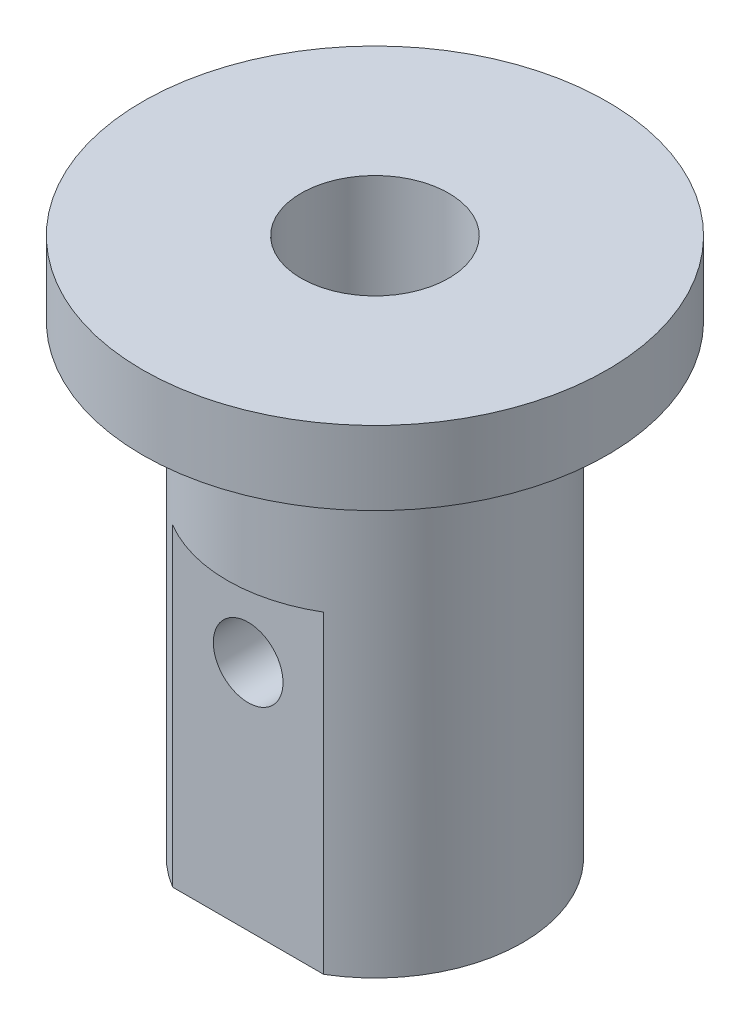
ISO-10303-21;
HEADER;
FILE_DESCRIPTION(('STEP AP214'),'2;1');
FILE_NAME('part.step','',(''),(''),'','','');
FILE_SCHEMA(('AUTOMOTIVE_DESIGN { 1 0 10303 214 1 1 1 1 }'));
ENDSEC;
DATA;
#1=APPLICATION_CONTEXT('core data for automotive mechanical design processes');
#2=APPLICATION_PROTOCOL_DEFINITION('international standard','automotive_design',2000,#1);
#3=PRODUCT_CONTEXT('',#1,'mechanical');
#4=PRODUCT('Part','Part','',(#3));
#5=PRODUCT_RELATED_PRODUCT_CATEGORY('part','',(#4));
#6=PRODUCT_DEFINITION_FORMATION('','',#4);
#7=PRODUCT_DEFINITION_CONTEXT('part definition',#1,'design');
#8=PRODUCT_DEFINITION('design','',#6,#7);
#9=PRODUCT_DEFINITION_SHAPE('','',#8);
#10=(LENGTH_UNIT() NAMED_UNIT(*) SI_UNIT(.MILLI.,.METRE.));
#11=(NAMED_UNIT(*) PLANE_ANGLE_UNIT() SI_UNIT($,.RADIAN.));
#12=(NAMED_UNIT(*) SI_UNIT($,.STERADIAN.) SOLID_ANGLE_UNIT());
#13=UNCERTAINTY_MEASURE_WITH_UNIT(LENGTH_MEASURE(1.E-05),#10,'distance_accuracy_value','');
#14=(GEOMETRIC_REPRESENTATION_CONTEXT(3) GLOBAL_UNCERTAINTY_ASSIGNED_CONTEXT((#13)) GLOBAL_UNIT_ASSIGNED_CONTEXT((#10,
#11,#12)) REPRESENTATION_CONTEXT('',''));
#15=CARTESIAN_POINT('',(0.,0.,0.));
#16=DIRECTION('',(0.,0.,1.));
#17=DIRECTION('',(1.,0.,0.));
#18=AXIS2_PLACEMENT_3D('',#15,#16,#17);
#19=CARTESIAN_POINT('',(0.,20.,0.));
#20=DIRECTION('',(0.,-1.,0.));
#21=DIRECTION('',(0.,0.,-1.));
#22=AXIS2_PLACEMENT_3D('',#19,#20,#21);
#23=CYLINDRICAL_SURFACE('',#22,6.35);
#24=CARTESIAN_POINT('',(0.,20.,0.));
#25=DIRECTION('',(0.,1.,0.));
#26=DIRECTION('',(0.,0.,1.));
#27=AXIS2_PLACEMENT_3D('',#24,#25,#26);
#28=CIRCLE('',#27,6.35);
#29=CARTESIAN_POINT('',(0.,20.,6.35));
#30=VERTEX_POINT('',#29);
#31=EDGE_CURVE('E124',#30,#30,#28,.T.);
#32=ORIENTED_EDGE('',*,*,#31,.F.);
#33=EDGE_LOOP('',(#32));
#34=FACE_BOUND('',#33,.T.);
#35=CARTESIAN_POINT('',(0.,13.5,0.));
#36=DIRECTION('',(0.,1.,0.));
#37=DIRECTION('',(0.,0.,1.));
#38=AXIS2_PLACEMENT_3D('',#35,#36,#37);
#39=CIRCLE('',#38,6.35);
#40=CARTESIAN_POINT('',(3.25,13.5,-5.45527267879434));
#41=VERTEX_POINT('',#40);
#42=CARTESIAN_POINT('',(-3.25,13.5,-5.45527267879434));
#43=VERTEX_POINT('',#42);
#44=EDGE_CURVE('E12',#41,#43,#39,.T.);
#45=ORIENTED_EDGE('',*,*,#44,.T.);
#46=DIRECTION('',(0.,-1.,0.));
#47=VECTOR('',#46,1.);
#48=CARTESIAN_POINT('',(-3.25,13.5,-5.45527267879434));
#49=LINE('',#48,#47);
#50=CARTESIAN_POINT('',(-3.25,0.,-5.45527267879434));
#51=VERTEX_POINT('',#50);
#52=EDGE_CURVE('E90',#43,#51,#49,.T.);
#53=ORIENTED_EDGE('',*,*,#52,.T.);
#54=CARTESIAN_POINT('',(0.,0.,0.));
#55=DIRECTION('',(0.,1.,0.));
#56=DIRECTION('',(0.,0.,1.));
#57=AXIS2_PLACEMENT_3D('',#54,#55,#56);
#58=CIRCLE('',#57,6.35);
#59=CARTESIAN_POINT('',(-3.25,0.,5.45527267879434));
#60=VERTEX_POINT('',#59);
#61=EDGE_CURVE('E123',#51,#60,#58,.T.);
#62=ORIENTED_EDGE('',*,*,#61,.T.);
#63=DIRECTION('',(0.,-1.,0.));
#64=VECTOR('',#63,1.);
#65=CARTESIAN_POINT('',(-3.25,13.5,5.45527267879434));
#66=LINE('',#65,#64);
#67=CARTESIAN_POINT('',(-3.25,13.5,5.45527267879434));
#68=VERTEX_POINT('',#67);
#69=EDGE_CURVE('E58',#68,#60,#66,.T.);
#70=ORIENTED_EDGE('',*,*,#69,.F.);
#71=CARTESIAN_POINT('',(0.,13.5,0.));
#72=DIRECTION('',(0.,-1.,0.));
#73=DIRECTION('',(0.,0.,-1.));
#74=AXIS2_PLACEMENT_3D('',#71,#72,#73);
#75=CIRCLE('',#74,6.35);
#76=CARTESIAN_POINT('',(3.25,13.5,5.45527267879434));
#77=VERTEX_POINT('',#76);
#78=EDGE_CURVE('E51',#77,#68,#75,.T.);
#79=ORIENTED_EDGE('',*,*,#78,.F.);
#80=DIRECTION('',(0.,-1.,0.));
#81=VECTOR('',#80,1.);
#82=CARTESIAN_POINT('',(3.25,13.5,5.45527267879434));
#83=LINE('',#82,#81);
#84=CARTESIAN_POINT('',(3.25,0.,5.45527267879434));
#85=VERTEX_POINT('',#84);
#86=EDGE_CURVE('E104',#77,#85,#83,.T.);
#87=ORIENTED_EDGE('',*,*,#86,.T.);
#88=CARTESIAN_POINT('',(3.25,0.,-5.45527267879434));
#89=VERTEX_POINT('',#88);
#90=EDGE_CURVE('E96',#85,#89,#58,.T.);
#91=ORIENTED_EDGE('',*,*,#90,.T.);
#92=DIRECTION('',(0.,-1.,0.));
#93=VECTOR('',#92,1.);
#94=CARTESIAN_POINT('',(3.25,13.5,-5.45527267879434));
#95=LINE('',#94,#93);
#96=EDGE_CURVE('E66',#41,#89,#95,.T.);
#97=ORIENTED_EDGE('',*,*,#96,.F.);
#98=EDGE_LOOP('',(#45,#53,#62,#70,#79,#87,#91,#97));
#99=FACE_BOUND('',#98,.T.);
#100=ADVANCED_FACE('F44',(#34,#99),#23,.T.);
#101=CARTESIAN_POINT('',(0.,20.,0.));
#102=DIRECTION('',(0.,-1.,0.));
#103=DIRECTION('',(0.,0.,-1.));
#104=AXIS2_PLACEMENT_3D('',#101,#102,#103);
#105=CYLINDRICAL_SURFACE('',#104,3.175);
#106=CARTESIAN_POINT('',(-1.5,10.,2.7983253920872));
#107=CARTESIAN_POINT('',(-1.49999523547047,9.92118925239897,2.79833097649977));
#108=CARTESIAN_POINT('',(-1.49374832449328,9.84226438779427,2.80170427159323));
#109=CARTESIAN_POINT('',(-1.4690554061353,9.68678533248531,2.81472644561665));
#110=CARTESIAN_POINT('',(-1.45058101361493,9.61023709283711,2.82438992585351));
#111=CARTESIAN_POINT('',(-1.40237253355636,9.46204732624327,2.84863009396432));
#112=CARTESIAN_POINT('',(-1.37269332197988,9.39038386356818,2.86318279906116));
#113=CARTESIAN_POINT('',(-1.30308399064543,9.25307060715241,2.89552502377023));
#114=CARTESIAN_POINT('',(-1.26315430701281,9.1874205577211,2.91331440566267));
#115=CARTESIAN_POINT('',(-1.1707430871524,9.0586767547416,2.95172227722859));
#116=CARTESIAN_POINT('',(-1.11755658650795,8.99612211150932,2.97245254188493));
#117=CARTESIAN_POINT('',(-1.00161259672222,8.88040856315064,3.01349951044786));
#118=CARTESIAN_POINT('',(-0.938850772491946,8.82725393739959,3.03381602228766));
#119=CARTESIAN_POINT('',(-0.801034900704516,8.72881062045223,3.07317288716969));
#120=CARTESIAN_POINT('',(-0.725476017233365,8.68416549874825,3.09206866660246));
#121=CARTESIAN_POINT('',(-0.566861686619155,8.60846247793824,3.12503381595021));
#122=CARTESIAN_POINT('',(-0.48381050702355,8.57739690225473,3.13910591174128));
#123=CARTESIAN_POINT('',(-0.318263833167133,8.53180568014383,3.16003750546179));
#124=CARTESIAN_POINT('',(-0.23607983759682,8.5163401993996,3.16730464125021));
#125=CARTESIAN_POINT('',(-0.0699854874354077,8.49931330153705,3.17531500926786));
#126=CARTESIAN_POINT('',(0.0139239243031285,8.49774448287966,3.17606171435844));
#127=CARTESIAN_POINT('',(0.17410404695592,8.50814689261954,3.1711569999128));
#128=CARTESIAN_POINT('',(0.250460926307548,8.5190736315719,3.16599910390162));
#129=CARTESIAN_POINT('',(0.400106757592312,8.55231548800514,3.15058713309443));
#130=CARTESIAN_POINT('',(0.473395481043943,8.57463145199998,3.14033267949386));
#131=CARTESIAN_POINT('',(0.616162159992469,8.63021819188029,3.11549383971164));
#132=CARTESIAN_POINT('',(0.685567785451935,8.66364599997404,3.10084769916082));
#133=CARTESIAN_POINT('',(0.817962218284117,8.74031903647797,3.06858481389696));
#134=CARTESIAN_POINT('',(0.880948663490015,8.78356786011826,3.05096698193041));
#135=CARTESIAN_POINT('',(1.00453666893054,8.88298223432991,3.01265189942243));
#136=CARTESIAN_POINT('',(1.0644578414785,8.93994263196852,2.9918200943109));
#137=CARTESIAN_POINT('',(1.17424124933889,9.06300294035556,2.95046283361779));
#138=CARTESIAN_POINT('',(1.2240971710571,9.12910854404884,2.92993757775203));
#139=CARTESIAN_POINT('',(1.31484174230845,9.27282786184892,2.89039711066438));
#140=CARTESIAN_POINT('',(1.35512986365461,9.35086105800371,2.87151577260243));
#141=CARTESIAN_POINT('',(1.42170562946273,9.51371625646897,2.83914834140001));
#142=CARTESIAN_POINT('',(1.44800645544408,9.59853178012437,2.82565717160027));
#143=CARTESIAN_POINT('',(1.48387059914899,9.7657462952624,2.80697974613979));
#144=CARTESIAN_POINT('',(1.4945499135996,9.84784244193015,2.80124227464673));
#145=CARTESIAN_POINT('',(1.50221328025957,10.0128364544629,2.79714234532468));
#146=CARTESIAN_POINT('',(1.49920488189903,10.0957338532269,2.79877582206013));
#147=CARTESIAN_POINT('',(1.4806017347564,10.2518411011807,2.80865284380239));
#148=CARTESIAN_POINT('',(1.46619608896935,10.3252381335397,2.81627144126264));
#149=CARTESIAN_POINT('',(1.42690562153975,10.4684636330514,2.83637948512089));
#150=CARTESIAN_POINT('',(1.40201781025962,10.5382910757385,2.8488703210638));
#151=CARTESIAN_POINT('',(1.3412324594274,10.676035807525,2.87800314814948));
#152=CARTESIAN_POINT('',(1.30487958898417,10.7437159941401,2.89481019393091));
#153=CARTESIAN_POINT('',(1.22260967416881,10.8723898286007,2.93050507850425));
#154=CARTESIAN_POINT('',(1.17668785898318,10.933380117806,2.94939395301752));
#155=CARTESIAN_POINT('',(1.07066250220429,11.0539512242928,2.98962533435876));
#156=CARTESIAN_POINT('',(1.00955462247668,11.1126390091907,3.0110091844446));
#157=CARTESIAN_POINT('',(0.877952835832726,11.2191662131219,3.05197816465585));
#158=CARTESIAN_POINT('',(0.807456777596014,11.2670031388463,3.07156288076261));
#159=CARTESIAN_POINT('',(0.657374049291597,11.351063404327,3.10717258491727));
#160=CARTESIAN_POINT('',(0.577656753882327,11.3870824417787,3.12313361565429));
#161=CARTESIAN_POINT('',(0.412327293299584,11.4448659350236,3.14922093597641));
#162=CARTESIAN_POINT('',(0.326719797872879,11.4666415423121,3.15935178938716));
#163=CARTESIAN_POINT('',(0.159896332874224,11.4936388943546,3.17197971044583));
#164=CARTESIAN_POINT('',(0.0789253982840799,11.5001101363264,3.17505233840112));
#165=CARTESIAN_POINT('',(-0.0829833461657156,11.4998871196568,3.17494636529876));
#166=CARTESIAN_POINT('',(-0.163921158963002,11.4931965351109,3.17176950877122));
#167=CARTESIAN_POINT('',(-0.318841842835546,11.4677084802309,3.15985410378094));
#168=CARTESIAN_POINT('',(-0.392963167600613,11.4495919749199,3.15142868675494));
#169=CARTESIAN_POINT('',(-0.53702643402249,11.4026210854748,3.13010132928976));
#170=CARTESIAN_POINT('',(-0.606967708474028,11.3737649924088,3.1171986764347));
#171=CARTESIAN_POINT('',(-0.744198443618437,11.3047349018929,3.08738510301285));
#172=CARTESIAN_POINT('',(-0.811226286131092,11.2641093939082,3.0703197298679));
#173=CARTESIAN_POINT('',(-0.937805412907552,11.1732843209197,3.03405477724481));
#174=CARTESIAN_POINT('',(-0.997353281796322,11.1230804085548,3.01485423033003));
#175=CARTESIAN_POINT('',(-1.11287613406119,11.0092844677808,2.97425749382228));
#176=CARTESIAN_POINT('',(-1.16805442942683,10.9448963731736,2.9528185885393));
#177=CARTESIAN_POINT('',(-1.26705651381277,10.8073121457485,2.91171333700677));
#178=CARTESIAN_POINT('',(-1.31087196019012,10.7341095987445,2.89204830000693));
#179=CARTESIAN_POINT('',(-1.3863737982034,10.5792324222108,2.85663554941127));
#180=CARTESIAN_POINT('',(-1.41785130272302,10.4974393525252,2.84095675906997));
#181=CARTESIAN_POINT('',(-1.4661232120466,10.3288119983292,2.81635628214136));
#182=CARTESIAN_POINT('',(-1.48296690968124,10.2419956966721,2.80741192483264));
#183=CARTESIAN_POINT('',(-1.49469268672873,10.128694633248,2.80116429672363));
#184=CARTESIAN_POINT('',(-1.49668048940514,10.1030118077476,2.80010260103933));
#185=CARTESIAN_POINT('',(-1.49933495903092,10.0515567295082,2.79868221732461));
#186=CARTESIAN_POINT('',(-1.50000155880871,10.0257844722891,2.79832356503778));
#187=CARTESIAN_POINT('',(-1.5,10.,2.7983253920872));
#188=B_SPLINE_CURVE_WITH_KNOTS('',3,(#106,#107,#108,#109,#110,#111,#112,#113,#114,#115,#116,
#117,#118,#119,#120,#121,#122,#123,#124,#125,#126,#127,#128,#129,#130,#131,#132,#133,#134,#135,
#136,#137,#138,#139,#140,#141,#142,#143,#144,#145,#146,#147,#148,#149,#150,#151,#152,#153,#154,
#155,#156,#157,#158,#159,#160,#161,#162,#163,#164,#165,#166,#167,#168,#169,#170,#171,#172,#173,
#174,#175,#176,#177,#178,#179,#180,#181,#182,#183,#184,#185,#186,#187),.UNSPECIFIED.,.T.,.F.,(4,
2,2,2,2,2,2,2,2,2,2,2,2,2,2,2,2,2,2,2,2,2,2,2,2,2,2,2,2,2,2,2,2,2,2,2,2,2,2,2,4),(0.,
0.236323871838545,0.473198284289301,0.708927337380701,0.944646362603914,1.19762429635865,
1.45071710395354,1.71864285343498,1.98641694681215,2.23687152724756,2.48719270436037,
2.71802817018661,2.94888079555674,3.1831453100556,3.41749572162706,3.67216706074964,
3.92699765369087,4.19506898546716,4.46288723920479,4.71043828617547,4.95785281342715,
5.18239796950746,5.40700721193729,5.64198832122138,5.87708686716682,6.13804637958084,
6.39906579463174,6.66438519401193,6.92949661955738,7.17207877892644,7.41459323161728,
7.64386670961211,7.87317668624822,8.11282240294707,8.35257714778319,8.61378861881715,
8.87519133270404,9.14084608292566,9.40560248746477,9.48291651801969,9.56023447921351),.UNSPECIFIED.);
#189=CARTESIAN_POINT('',(-1.5,10.,2.7983253920872));
#190=VERTEX_POINT('',#189);
#191=EDGE_CURVE('E129',#190,#190,#188,.T.);
#192=ORIENTED_EDGE('',*,*,#191,.T.);
#193=EDGE_LOOP('',(#192));
#194=FACE_BOUND('',#193,.T.);
#195=CARTESIAN_POINT('',(0.,0.,0.));
#196=DIRECTION('',(0.,1.,0.));
#197=DIRECTION('',(0.,0.,1.));
#198=AXIS2_PLACEMENT_3D('',#195,#196,#197);
#199=CIRCLE('',#198,3.175);
#200=CARTESIAN_POINT('',(0.,0.,3.175));
#201=VERTEX_POINT('',#200);
#202=EDGE_CURVE('E118',#201,#201,#199,.T.);
#203=ORIENTED_EDGE('',*,*,#202,.F.);
#204=EDGE_LOOP('',(#203));
#205=FACE_BOUND('',#204,.T.);
#206=CARTESIAN_POINT('',(0.,23.175,0.));
#207=DIRECTION('',(0.,1.,0.));
#208=DIRECTION('',(0.,0.,1.));
#209=AXIS2_PLACEMENT_3D('',#206,#207,#208);
#210=CIRCLE('',#209,3.175);
#211=CARTESIAN_POINT('',(0.,23.175,3.175));
#212=VERTEX_POINT('',#211);
#213=EDGE_CURVE('E110',#212,#212,#210,.T.);
#214=ORIENTED_EDGE('',*,*,#213,.T.);
#215=EDGE_LOOP('',(#214));
#216=FACE_BOUND('',#215,.T.);
#217=CARTESIAN_POINT('',(0.,11.5,-3.175));
#218=CARTESIAN_POINT('',(0.0793696056331878,11.4999955261035,-3.17499621985294));
#219=CARTESIAN_POINT('',(0.158848966213319,11.4936633534842,-3.17199120370814));
#220=CARTESIAN_POINT('',(0.3154907966577,11.4685996128575,-3.16026762742416));
#221=CARTESIAN_POINT('',(0.392647876041672,11.4498412211258,-3.15153670753249));
#222=CARTESIAN_POINT('',(0.54213461401645,11.4008046338603,-3.1292818514019));
#223=CARTESIAN_POINT('',(0.614481134826974,11.370569474688,-3.11577583396693));
#224=CARTESIAN_POINT('',(0.752982757479881,11.2996444683175,-3.08523557557938));
#225=CARTESIAN_POINT('',(0.819138798737005,11.2589562109142,-3.06820187122341));
#226=CARTESIAN_POINT('',(0.947531977551392,11.1656866275469,-3.03109215002452));
#227=CARTESIAN_POINT('',(1.00934531536298,11.1125689176526,-3.01089949607389));
#228=CARTESIAN_POINT('',(1.12356872804671,10.9970940154181,-2.97016877751052));
#229=CARTESIAN_POINT('',(1.17597245123061,10.9347306335115,-2.94963048974006));
#230=CARTESIAN_POINT('',(1.27340721108708,10.7974843645497,-2.90895734211161));
#231=CARTESIAN_POINT('',(1.31770529611402,10.7220415431448,-2.88894252906622));
#232=CARTESIAN_POINT('',(1.39279860497067,10.5637145060508,-2.85350194913633));
#233=CARTESIAN_POINT('',(1.4236026358555,10.4808351865709,-2.83807319122874));
#234=CARTESIAN_POINT('',(1.46896762087975,10.3148173299765,-2.81484981523147));
#235=CARTESIAN_POINT('',(1.48434942407678,10.2319591045865,-2.80667245171199));
#236=CARTESIAN_POINT('',(1.50096994970779,10.0644666996695,-2.79782290647243));
#237=CARTESIAN_POINT('',(1.5022201551264,9.97983401805994,-2.79714463118969));
#238=CARTESIAN_POINT('',(1.49114871052963,9.82062469140227,-2.80305593263808));
#239=CARTESIAN_POINT('',(1.48022366031689,9.74591684055565,-2.80889771224103));
#240=CARTESIAN_POINT('',(1.44750469243097,9.59955531913525,-2.82589657910714));
#241=CARTESIAN_POINT('',(1.42570787921159,9.52790246774061,-2.83705508237193));
#242=CARTESIAN_POINT('',(1.37144042107045,9.38767854274785,-2.86368711079333));
#243=CARTESIAN_POINT('',(1.33873421633754,9.3192173067294,-2.87925460442575));
#244=CARTESIAN_POINT('',(1.26375034917989,9.18844422930819,-2.91294481240157));
#245=CARTESIAN_POINT('',(1.22146847336964,9.12613511227864,-2.93106865023239));
#246=CARTESIAN_POINT('',(1.12301829304094,9.00211398210142,-2.97027967308475));
#247=CARTESIAN_POINT('',(1.06582685913966,8.94124465826451,-2.99147184174414));
#248=CARTESIAN_POINT('',(0.941911654521739,8.82963307898786,-3.03276969244737));
#249=CARTESIAN_POINT('',(0.875184240523149,8.77889471198725,-3.05287495516681));
#250=CARTESIAN_POINT('',(0.730900451942526,8.68723446950541,-3.09065813188422));
#251=CARTESIAN_POINT('',(0.65303276474939,8.6467498749094,-3.10821737934191));
#252=CARTESIAN_POINT('',(0.490549806409964,8.57976514725872,-3.13795896561378));
#253=CARTESIAN_POINT('',(0.405939389394616,8.55325505672055,-3.15014513198241));
#254=CARTESIAN_POINT('',(0.239325331183663,8.51695327830054,-3.16698849385516));
#255=CARTESIAN_POINT('',(0.157618085372369,8.50603697774867,-3.17215069636453));
#256=CARTESIAN_POINT('',(-0.00662006237334089,8.49776549827472,-3.17605374308904));
#257=CARTESIAN_POINT('',(-0.0891506200914322,8.50040487103399,-3.17479716715133));
#258=CARTESIAN_POINT('',(-0.246790904756254,8.51845895022593,-3.16631250425399));
#259=CARTESIAN_POINT('',(-0.322025617263288,8.53299968212115,-3.15949303898597));
#260=CARTESIAN_POINT('',(-0.468859911387632,8.57312746629385,-3.14106249856194));
#261=CARTESIAN_POINT('',(-0.540459070755478,8.59871579842438,-3.12945086824544));
#262=CARTESIAN_POINT('',(-0.680482664613305,8.66097277598054,-3.10206629000487));
#263=CARTESIAN_POINT('',(-0.748744433690325,8.69795459585581,-3.0861775760538));
#264=CARTESIAN_POINT('',(-0.878333413113474,8.78160542554883,-3.05182842645659));
#265=CARTESIAN_POINT('',(-0.939657562453442,8.82827868585652,-3.0333668635778));
#266=CARTESIAN_POINT('',(-1.05944471500475,8.93484016430619,-2.99374847615918));
#267=CARTESIAN_POINT('',(-1.11715821701519,8.99553803008255,-2.97249840501299));
#268=CARTESIAN_POINT('',(-1.22187582163969,9.12592004337329,-2.9310107026401));
#269=CARTESIAN_POINT('',(-1.26887443843489,9.19560876557417,-2.91077359415055));
#270=CARTESIAN_POINT('',(-1.3523177360002,9.34515860569975,-2.8729842223829));
#271=CARTESIAN_POINT('',(-1.3883357483136,9.42529027685059,-2.85555063245793));
#272=CARTESIAN_POINT('',(-1.44599796651068,9.59157573608092,-2.82679504093384));
#273=CARTESIAN_POINT('',(-1.46765854978947,9.67772253828127,-2.81546607860886));
#274=CARTESIAN_POINT('',(-1.49416555358527,9.84513659709301,-2.80148148307169));
#275=CARTESIAN_POINT('',(-1.50036748851185,9.92613047173134,-2.79812792823293));
#276=CARTESIAN_POINT('',(-1.4995991124721,10.0880256718279,-2.79854075870541));
#277=CARTESIAN_POINT('',(-1.4926327833113,10.1689270178634,-2.80230499174775));
#278=CARTESIAN_POINT('',(-1.46695547456854,10.3218618581667,-2.81582109373829));
#279=CARTESIAN_POINT('',(-1.44918362899975,10.394100315709,-2.82509293077013));
#280=CARTESIAN_POINT('',(-1.40347262111118,10.5345289541074,-2.84807658169596));
#281=CARTESIAN_POINT('',(-1.37553039996267,10.6027179098565,-2.86178973121637));
#282=CARTESIAN_POINT('',(-1.30816165903836,10.7381105518292,-2.89323433363553));
#283=CARTESIAN_POINT('',(-1.26809407534009,10.8049459695603,-2.9111726221189));
#284=CARTESIAN_POINT('',(-1.17838069734069,10.9313607981843,-2.94862781691945));
#285=CARTESIAN_POINT('',(-1.12873032344155,10.9909367174796,-2.96814547541437));
#286=CARTESIAN_POINT('',(-1.01518945377103,11.1075560784686,-3.00898948839188));
#287=CARTESIAN_POINT('',(-0.950355540908532,11.1636938134171,-3.03029315236505));
#288=CARTESIAN_POINT('',(-0.811506446201232,11.2644417542749,-3.07039060771353));
#289=CARTESIAN_POINT('',(-0.737486850130156,11.3090463858981,-3.08918318329392));
#290=CARTESIAN_POINT('',(-0.582310323359668,11.3850463197749,-3.12214803509559));
#291=CARTESIAN_POINT('',(-0.501179295246574,11.4164873338392,-3.13633626105316));
#292=CARTESIAN_POINT('',(-0.334041202489532,11.4649024240255,-3.15849550789229));
#293=CARTESIAN_POINT('',(-0.248049357078899,11.4819192475962,-3.16648489362115));
#294=CARTESIAN_POINT('',(-0.134449327489636,11.4942064333984,-3.17226666174443));
#295=CARTESIAN_POINT('',(-0.10761975081623,11.4963765519968,-3.17328951708221));
#296=CARTESIAN_POINT('',(-0.0538643319459684,11.4992741103809,-3.17465683516496));
#297=CARTESIAN_POINT('',(-0.026938487646813,11.5000015184655,-3.17500128300303));
#298=CARTESIAN_POINT('',(0.,11.5,-3.175));
#299=B_SPLINE_CURVE_WITH_KNOTS('',3,(#217,#218,#219,#220,#221,#222,#223,#224,#225,#226,#227,
#228,#229,#230,#231,#232,#233,#234,#235,#236,#237,#238,#239,#240,#241,#242,#243,#244,#245,#246,
#247,#248,#249,#250,#251,#252,#253,#254,#255,#256,#257,#258,#259,#260,#261,#262,#263,#264,#265,
#266,#267,#268,#269,#270,#271,#272,#273,#274,#275,#276,#277,#278,#279,#280,#281,#282,#283,#284,
#285,#286,#287,#288,#289,#290,#291,#292,#293,#294,#295,#296,#297,#298),.UNSPECIFIED.,.T.,.F.,(4,
2,2,2,2,2,2,2,2,2,2,2,2,2,2,2,2,2,2,2,2,2,2,2,2,2,2,2,2,2,2,2,2,2,2,2,2,2,2,2,4),(0.,
0.237998863435127,0.47651316203436,0.714141760487186,0.951734239756923,1.202566267352,
1.45356698050229,1.72144991719773,1.98915775546694,2.24170968929962,2.4940563909499,
2.72018464462581,2.94637315667183,3.17780125644152,3.40933138528568,3.66670059385932,
3.92416839616743,4.19124985366182,4.45814074508092,4.70459764976704,4.9509555058397,
5.18069145066332,5.41045401730286,5.6472008989094,5.88405183355053,6.14213867221335,
6.40035735120202,6.66760822573517,6.93455372246492,7.17710763594646,7.41958821796886,
7.64352093670395,7.86752106087491,8.10644389425159,8.34548119240929,8.60934561245708,
8.87333732850241,9.13640455025375,9.39868939422998,9.47946576344206,9.56024390756228),.UNSPECIFIED.);
#300=CARTESIAN_POINT('',(0.,11.5,-3.175));
#301=VERTEX_POINT('',#300);
#302=EDGE_CURVE('E114',#301,#301,#299,.T.);
#303=ORIENTED_EDGE('',*,*,#302,.T.);
#304=EDGE_LOOP('',(#303));
#305=FACE_BOUND('',#304,.T.);
#306=ADVANCED_FACE('F142',(#194,#205,#216,#305),#105,.F.);
#307=CARTESIAN_POINT('',(0.,0.,0.));
#308=DIRECTION('',(0.,1.,0.));
#309=DIRECTION('',(0.,0.,1.));
#310=AXIS2_PLACEMENT_3D('',#307,#308,#309);
#311=PLANE('',#310);
#312=ORIENTED_EDGE('',*,*,#61,.F.);
#313=DIRECTION('',(-1.,0.,0.));
#314=VECTOR('',#313,1.);
#315=CARTESIAN_POINT('',(3.25,0.,-5.45527267879434));
#316=LINE('',#315,#314);
#317=EDGE_CURVE('E91',#89,#51,#316,.T.);
#318=ORIENTED_EDGE('',*,*,#317,.F.);
#319=ORIENTED_EDGE('',*,*,#90,.F.);
#320=DIRECTION('',(1.,0.,0.));
#321=VECTOR('',#320,1.);
#322=CARTESIAN_POINT('',(3.25,0.,5.45527267879434));
#323=LINE('',#322,#321);
#324=EDGE_CURVE('E106',#60,#85,#323,.T.);
#325=ORIENTED_EDGE('',*,*,#324,.F.);
#326=EDGE_LOOP('',(#312,#318,#319,#325));
#327=FACE_BOUND('',#326,.T.);
#328=ORIENTED_EDGE('',*,*,#202,.T.);
#329=EDGE_LOOP('',(#328));
#330=FACE_BOUND('',#329,.T.);
#331=ADVANCED_FACE('F159',(#327,#330),#311,.F.);
#332=CARTESIAN_POINT('',(0.,23.175,0.));
#333=DIRECTION('',(0.,1.,0.));
#334=DIRECTION('',(0.,0.,1.));
#335=AXIS2_PLACEMENT_3D('',#332,#333,#334);
#336=PLANE('',#335);
#337=CARTESIAN_POINT('',(0.,23.175,0.));
#338=DIRECTION('',(0.,1.,0.));
#339=DIRECTION('',(0.,0.,1.));
#340=AXIS2_PLACEMENT_3D('',#337,#338,#339);
#341=CIRCLE('',#340,10.);
#342=CARTESIAN_POINT('',(0.,23.175,10.));
#343=VERTEX_POINT('',#342);
#344=EDGE_CURVE('E115',#343,#343,#341,.T.);
#345=ORIENTED_EDGE('',*,*,#344,.T.);
#346=EDGE_LOOP('',(#345));
#347=FACE_BOUND('',#346,.T.);
#348=ORIENTED_EDGE('',*,*,#213,.F.);
#349=EDGE_LOOP('',(#348));
#350=FACE_BOUND('',#349,.T.);
#351=ADVANCED_FACE('F154',(#347,#350),#336,.T.);
#352=CARTESIAN_POINT('',(0.,20.,0.));
#353=DIRECTION('',(0.,1.,0.));
#354=DIRECTION('',(0.,0.,1.));
#355=AXIS2_PLACEMENT_3D('',#352,#353,#354);
#356=PLANE('',#355);
#357=ORIENTED_EDGE('',*,*,#31,.T.);
#358=EDGE_LOOP('',(#357));
#359=FACE_BOUND('',#358,.T.);
#360=CARTESIAN_POINT('',(0.,20.,0.));
#361=DIRECTION('',(0.,1.,0.));
#362=DIRECTION('',(0.,0.,1.));
#363=AXIS2_PLACEMENT_3D('',#360,#361,#362);
#364=CIRCLE('',#363,10.);
#365=CARTESIAN_POINT('',(0.,20.,10.));
#366=VERTEX_POINT('',#365);
#367=EDGE_CURVE('E113',#366,#366,#364,.T.);
#368=ORIENTED_EDGE('',*,*,#367,.F.);
#369=EDGE_LOOP('',(#368));
#370=FACE_BOUND('',#369,.T.);
#371=ADVANCED_FACE('F158',(#359,#370),#356,.F.);
#372=CARTESIAN_POINT('',(0.,23.175,0.));
#373=DIRECTION('',(0.,-1.,0.));
#374=DIRECTION('',(0.,0.,-1.));
#375=AXIS2_PLACEMENT_3D('',#372,#373,#374);
#376=CYLINDRICAL_SURFACE('',#375,10.);
#377=ORIENTED_EDGE('',*,*,#344,.F.);
#378=EDGE_LOOP('',(#377));
#379=FACE_BOUND('',#378,.T.);
#380=ORIENTED_EDGE('',*,*,#367,.T.);
#381=EDGE_LOOP('',(#380));
#382=FACE_BOUND('',#381,.T.);
#383=ADVANCED_FACE('F162',(#379,#382),#376,.T.);
#384=CARTESIAN_POINT('',(0.,10.,10.));
#385=DIRECTION('',(0.,0.,-1.));
#386=DIRECTION('',(-1.,0.,0.));
#387=AXIS2_PLACEMENT_3D('',#384,#385,#386);
#388=CYLINDRICAL_SURFACE('',#387,1.5);
#389=CARTESIAN_POINT('',(0.,10.,5.45527267879434));
#390=DIRECTION('',(0.,0.,-1.));
#391=DIRECTION('',(-1.,0.,0.));
#392=AXIS2_PLACEMENT_3D('',#389,#390,#391);
#393=CIRCLE('',#392,1.5);
#394=CARTESIAN_POINT('',(-1.5,10.,5.45527267879434));
#395=VERTEX_POINT('',#394);
#396=EDGE_CURVE('E137',#395,#395,#393,.T.);
#397=ORIENTED_EDGE('',*,*,#396,.F.);
#398=EDGE_LOOP('',(#397));
#399=FACE_BOUND('',#398,.T.);
#400=ORIENTED_EDGE('',*,*,#191,.F.);
#401=EDGE_LOOP('',(#400));
#402=FACE_BOUND('',#401,.T.);
#403=ADVANCED_FACE('F150',(#399,#402),#388,.F.);
#404=CARTESIAN_POINT('',(0.,10.,-5.45527267879434));
#405=DIRECTION('',(0.,0.,1.));
#406=DIRECTION('',(1.,0.,0.));
#407=AXIS2_PLACEMENT_3D('',#404,#405,#406);
#408=CIRCLE('',#407,1.5);
#409=CARTESIAN_POINT('',(1.5,10.,-5.45527267879434));
#410=VERTEX_POINT('',#409);
#411=EDGE_CURVE('E98',#410,#410,#408,.T.);
#412=ORIENTED_EDGE('',*,*,#411,.F.);
#413=EDGE_LOOP('',(#412));
#414=FACE_BOUND('',#413,.T.);
#415=ORIENTED_EDGE('',*,*,#302,.F.);
#416=EDGE_LOOP('',(#415));
#417=FACE_BOUND('',#416,.T.);
#418=ADVANCED_FACE('F145',(#414,#417),#388,.F.);
#419=CARTESIAN_POINT('',(0.,13.5,0.));
#420=DIRECTION('',(0.,1.,0.));
#421=DIRECTION('',(0.,0.,1.));
#422=AXIS2_PLACEMENT_3D('',#419,#420,#421);
#423=PLANE('',#422);
#424=DIRECTION('',(-1.,0.,0.));
#425=VECTOR('',#424,1.);
#426=CARTESIAN_POINT('',(3.25,13.5,-5.45527267879434));
#427=LINE('',#426,#425);
#428=EDGE_CURVE('E86',#41,#43,#427,.T.);
#429=ORIENTED_EDGE('',*,*,#428,.T.);
#430=ORIENTED_EDGE('',*,*,#44,.F.);
#431=EDGE_LOOP('',(#429,#430));
#432=FACE_BOUND('',#431,.T.);
#433=ADVANCED_FACE('F85',(#432),#423,.F.);
#434=CARTESIAN_POINT('',(3.25,13.5,-5.45527267879434));
#435=DIRECTION('',(0.,0.,1.));
#436=DIRECTION('',(1.,0.,0.));
#437=AXIS2_PLACEMENT_3D('',#434,#435,#436);
#438=PLANE('',#437);
#439=ORIENTED_EDGE('',*,*,#411,.T.);
#440=EDGE_LOOP('',(#439));
#441=FACE_BOUND('',#440,.T.);
#442=ORIENTED_EDGE('',*,*,#317,.T.);
#443=ORIENTED_EDGE('',*,*,#52,.F.);
#444=ORIENTED_EDGE('',*,*,#428,.F.);
#445=ORIENTED_EDGE('',*,*,#96,.T.);
#446=EDGE_LOOP('',(#442,#443,#444,#445));
#447=FACE_BOUND('',#446,.T.);
#448=ADVANCED_FACE('F89',(#441,#447),#438,.F.);
#449=CARTESIAN_POINT('',(0.,13.5,0.));
#450=DIRECTION('',(0.,-1.,0.));
#451=DIRECTION('',(0.,0.,-1.));
#452=AXIS2_PLACEMENT_3D('',#449,#450,#451);
#453=PLANE('',#452);
#454=DIRECTION('',(1.,0.,0.));
#455=VECTOR('',#454,1.);
#456=CARTESIAN_POINT('',(3.25,13.5,5.45527267879434));
#457=LINE('',#456,#455);
#458=EDGE_CURVE('E103',#68,#77,#457,.T.);
#459=ORIENTED_EDGE('',*,*,#458,.T.);
#460=ORIENTED_EDGE('',*,*,#78,.T.);
#461=EDGE_LOOP('',(#459,#460));
#462=FACE_BOUND('',#461,.T.);
#463=ADVANCED_FACE('F152',(#462),#453,.T.);
#464=CARTESIAN_POINT('',(3.25,13.5,5.45527267879434));
#465=DIRECTION('',(0.,0.,-1.));
#466=DIRECTION('',(-1.,0.,0.));
#467=AXIS2_PLACEMENT_3D('',#464,#465,#466);
#468=PLANE('',#467);
#469=ORIENTED_EDGE('',*,*,#396,.T.);
#470=EDGE_LOOP('',(#469));
#471=FACE_BOUND('',#470,.T.);
#472=ORIENTED_EDGE('',*,*,#324,.T.);
#473=ORIENTED_EDGE('',*,*,#86,.F.);
#474=ORIENTED_EDGE('',*,*,#458,.F.);
#475=ORIENTED_EDGE('',*,*,#69,.T.);
#476=EDGE_LOOP('',(#472,#473,#474,#475));
#477=FACE_BOUND('',#476,.T.);
#478=ADVANCED_FACE('F203',(#471,#477),#468,.F.);
#479=CLOSED_SHELL('',(#100,#306,#331,#351,#371,#383,#403,#418,#433,#448,#463,#478));
#480=MANIFOLD_SOLID_BREP('B2',#479);
#481=ADVANCED_BREP_SHAPE_REPRESENTATION('',(#18,#480),#14);
#482=SHAPE_DEFINITION_REPRESENTATION(#9,#481);
ENDSEC;
END-ISO-10303-21;
